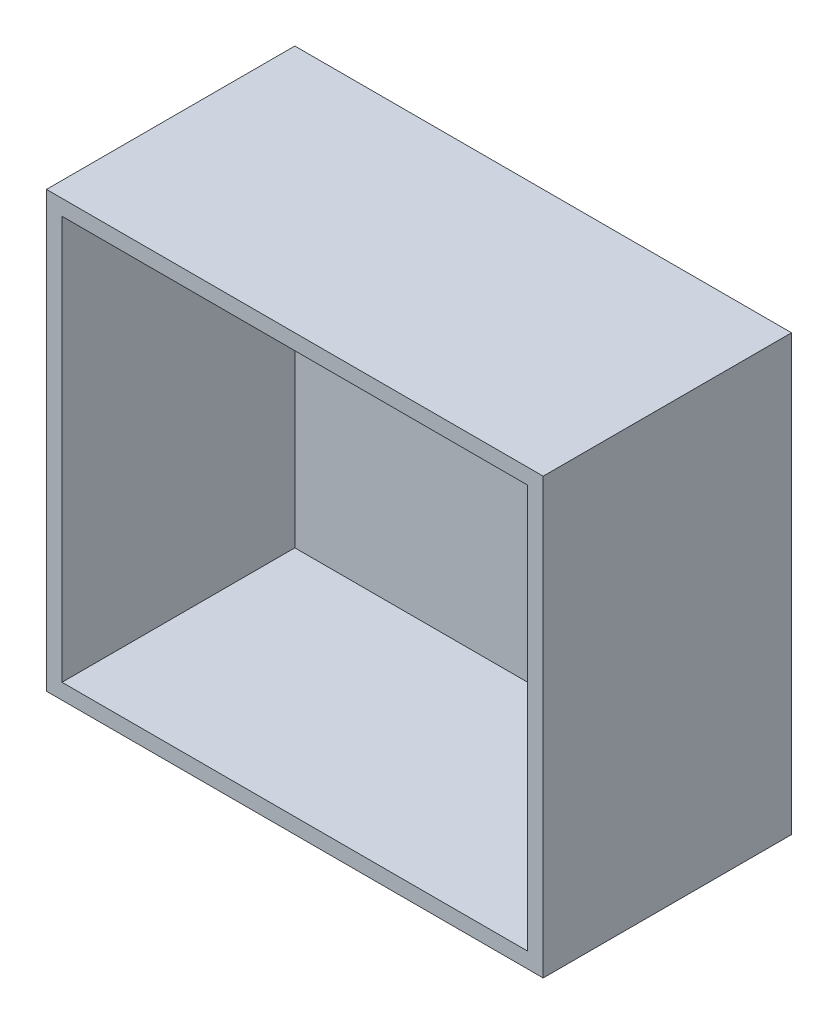
ISO-10303-21;
HEADER;
FILE_DESCRIPTION(('STEP AP214'),'2;1');
FILE_NAME('part.step','',(''),(''),'','','');
FILE_SCHEMA(('AUTOMOTIVE_DESIGN { 1 0 10303 214 1 1 1 1 }'));
ENDSEC;
DATA;
#1=APPLICATION_CONTEXT('core data for automotive mechanical design processes');
#2=APPLICATION_PROTOCOL_DEFINITION('international standard','automotive_design',2000,#1);
#3=PRODUCT_CONTEXT('',#1,'mechanical');
#4=PRODUCT('Part','Part','',(#3));
#5=PRODUCT_RELATED_PRODUCT_CATEGORY('part','',(#4));
#6=PRODUCT_DEFINITION_FORMATION('','',#4);
#7=PRODUCT_DEFINITION_CONTEXT('part definition',#1,'design');
#8=PRODUCT_DEFINITION('design','',#6,#7);
#9=PRODUCT_DEFINITION_SHAPE('','',#8);
#10=(LENGTH_UNIT() NAMED_UNIT(*) SI_UNIT(.MILLI.,.METRE.));
#11=(NAMED_UNIT(*) PLANE_ANGLE_UNIT() SI_UNIT($,.RADIAN.));
#12=(NAMED_UNIT(*) SI_UNIT($,.STERADIAN.) SOLID_ANGLE_UNIT());
#13=UNCERTAINTY_MEASURE_WITH_UNIT(LENGTH_MEASURE(1.E-05),#10,'distance_accuracy_value','');
#14=(GEOMETRIC_REPRESENTATION_CONTEXT(3) GLOBAL_UNCERTAINTY_ASSIGNED_CONTEXT((#13)) GLOBAL_UNIT_ASSIGNED_CONTEXT((#10,
#11,#12)) REPRESENTATION_CONTEXT('',''));
#15=CARTESIAN_POINT('',(0.,0.,0.));
#16=DIRECTION('',(0.,0.,1.));
#17=DIRECTION('',(1.,0.,0.));
#18=AXIS2_PLACEMENT_3D('',#15,#16,#17);
#19=CARTESIAN_POINT('',(0.,0.,32.));
#20=DIRECTION('',(1.,0.,0.));
#21=DIRECTION('',(0.,1.,0.));
#22=AXIS2_PLACEMENT_3D('',#19,#20,#21);
#23=PLANE('',#22);
#24=DIRECTION('',(0.,-1.,0.));
#25=VECTOR('',#24,1.);
#26=CARTESIAN_POINT('',(0.,0.,0.));
#27=LINE('',#26,#25);
#28=CARTESIAN_POINT('',(0.,56.,0.));
#29=VERTEX_POINT('',#28);
#30=CARTESIAN_POINT('',(0.,0.,0.));
#31=VERTEX_POINT('',#30);
#32=EDGE_CURVE('E164',#29,#31,#27,.T.);
#33=ORIENTED_EDGE('',*,*,#32,.T.);
#34=DIRECTION('',(0.,0.,-1.));
#35=VECTOR('',#34,1.);
#36=CARTESIAN_POINT('',(0.,0.,32.));
#37=LINE('',#36,#35);
#38=CARTESIAN_POINT('',(0.,0.,32.));
#39=VERTEX_POINT('',#38);
#40=EDGE_CURVE('E11',#39,#31,#37,.T.);
#41=ORIENTED_EDGE('',*,*,#40,.F.);
#42=DIRECTION('',(0.,-1.,0.));
#43=VECTOR('',#42,1.);
#44=CARTESIAN_POINT('',(0.,0.,32.));
#45=LINE('',#44,#43);
#46=CARTESIAN_POINT('',(0.,56.,32.));
#47=VERTEX_POINT('',#46);
#48=EDGE_CURVE('E170',#47,#39,#45,.T.);
#49=ORIENTED_EDGE('',*,*,#48,.F.);
#50=DIRECTION('',(0.,0.,-1.));
#51=VECTOR('',#50,1.);
#52=CARTESIAN_POINT('',(0.,56.,32.));
#53=LINE('',#52,#51);
#54=EDGE_CURVE('E180',#47,#29,#53,.T.);
#55=ORIENTED_EDGE('',*,*,#54,.T.);
#56=EDGE_LOOP('',(#33,#41,#49,#55));
#57=FACE_BOUND('',#56,.T.);
#58=ADVANCED_FACE('F45',(#57),#23,.F.);
#59=CARTESIAN_POINT('',(0.,0.,32.));
#60=DIRECTION('',(0.,1.,0.));
#61=DIRECTION('',(0.,0.,1.));
#62=AXIS2_PLACEMENT_3D('',#59,#60,#61);
#63=PLANE('',#62);
#64=DIRECTION('',(1.,0.,0.));
#65=VECTOR('',#64,1.);
#66=CARTESIAN_POINT('',(0.,0.,0.));
#67=LINE('',#66,#65);
#68=CARTESIAN_POINT('',(64.,0.,0.));
#69=VERTEX_POINT('',#68);
#70=EDGE_CURVE('E184',#31,#69,#67,.T.);
#71=ORIENTED_EDGE('',*,*,#70,.T.);
#72=DIRECTION('',(0.,0.,-1.));
#73=VECTOR('',#72,1.);
#74=CARTESIAN_POINT('',(64.,0.,32.));
#75=LINE('',#74,#73);
#76=CARTESIAN_POINT('',(64.,0.,32.));
#77=VERTEX_POINT('',#76);
#78=EDGE_CURVE('E53',#77,#69,#75,.T.);
#79=ORIENTED_EDGE('',*,*,#78,.F.);
#80=DIRECTION('',(1.,0.,0.));
#81=VECTOR('',#80,1.);
#82=CARTESIAN_POINT('',(0.,0.,32.));
#83=LINE('',#82,#81);
#84=EDGE_CURVE('E97',#39,#77,#83,.T.);
#85=ORIENTED_EDGE('',*,*,#84,.F.);
#86=ORIENTED_EDGE('',*,*,#40,.T.);
#87=EDGE_LOOP('',(#71,#79,#85,#86));
#88=FACE_BOUND('',#87,.T.);
#89=ADVANCED_FACE('F220',(#88),#63,.F.);
#90=CARTESIAN_POINT('',(64.,0.,32.));
#91=DIRECTION('',(-1.,0.,0.));
#92=DIRECTION('',(0.,0.,1.));
#93=AXIS2_PLACEMENT_3D('',#90,#91,#92);
#94=PLANE('',#93);
#95=DIRECTION('',(0.,1.,0.));
#96=VECTOR('',#95,1.);
#97=CARTESIAN_POINT('',(64.,0.,0.));
#98=LINE('',#97,#96);
#99=CARTESIAN_POINT('',(64.,56.,0.));
#100=VERTEX_POINT('',#99);
#101=EDGE_CURVE('E187',#69,#100,#98,.T.);
#102=ORIENTED_EDGE('',*,*,#101,.T.);
#103=DIRECTION('',(0.,0.,-1.));
#104=VECTOR('',#103,1.);
#105=CARTESIAN_POINT('',(64.,56.,32.));
#106=LINE('',#105,#104);
#107=CARTESIAN_POINT('',(64.,56.,32.));
#108=VERTEX_POINT('',#107);
#109=EDGE_CURVE('E194',#108,#100,#106,.T.);
#110=ORIENTED_EDGE('',*,*,#109,.F.);
#111=DIRECTION('',(0.,1.,0.));
#112=VECTOR('',#111,1.);
#113=CARTESIAN_POINT('',(64.,0.,32.));
#114=LINE('',#113,#112);
#115=EDGE_CURVE('E175',#77,#108,#114,.T.);
#116=ORIENTED_EDGE('',*,*,#115,.F.);
#117=ORIENTED_EDGE('',*,*,#78,.T.);
#118=EDGE_LOOP('',(#102,#110,#116,#117));
#119=FACE_BOUND('',#118,.T.);
#120=ADVANCED_FACE('F201',(#119),#94,.F.);
#121=CARTESIAN_POINT('',(0.,56.,32.));
#122=DIRECTION('',(0.,-1.,0.));
#123=DIRECTION('',(0.,0.,-1.));
#124=AXIS2_PLACEMENT_3D('',#121,#122,#123);
#125=PLANE('',#124);
#126=DIRECTION('',(-1.,0.,0.));
#127=VECTOR('',#126,1.);
#128=CARTESIAN_POINT('',(0.,56.,0.));
#129=LINE('',#128,#127);
#130=EDGE_CURVE('E90',#100,#29,#129,.T.);
#131=ORIENTED_EDGE('',*,*,#130,.T.);
#132=ORIENTED_EDGE('',*,*,#54,.F.);
#133=DIRECTION('',(-1.,0.,0.));
#134=VECTOR('',#133,1.);
#135=CARTESIAN_POINT('',(0.,56.,32.));
#136=LINE('',#135,#134);
#137=EDGE_CURVE('E69',#108,#47,#136,.T.);
#138=ORIENTED_EDGE('',*,*,#137,.F.);
#139=ORIENTED_EDGE('',*,*,#109,.T.);
#140=EDGE_LOOP('',(#131,#132,#138,#139));
#141=FACE_BOUND('',#140,.T.);
#142=ADVANCED_FACE('F209',(#141),#125,.F.);
#143=CARTESIAN_POINT('',(0.,0.,32.));
#144=DIRECTION('',(0.,0.,-1.));
#145=DIRECTION('',(-1.,0.,0.));
#146=AXIS2_PLACEMENT_3D('',#143,#144,#145);
#147=PLANE('',#146);
#148=DIRECTION('',(1.,0.,0.));
#149=VECTOR('',#148,1.);
#150=CARTESIAN_POINT('',(1.99999999999999,2.,32.));
#151=LINE('',#150,#149);
#152=CARTESIAN_POINT('',(1.99999999999999,2.,32.));
#153=VERTEX_POINT('',#152);
#154=CARTESIAN_POINT('',(62.,2.,32.));
#155=VERTEX_POINT('',#154);
#156=EDGE_CURVE('E155',#153,#155,#151,.T.);
#157=ORIENTED_EDGE('',*,*,#156,.F.);
#158=DIRECTION('',(0.,-1.,0.));
#159=VECTOR('',#158,1.);
#160=CARTESIAN_POINT('',(1.99999999999999,54.,32.));
#161=LINE('',#160,#159);
#162=CARTESIAN_POINT('',(1.99999999999999,54.,32.));
#163=VERTEX_POINT('',#162);
#164=EDGE_CURVE('E60',#163,#153,#161,.T.);
#165=ORIENTED_EDGE('',*,*,#164,.F.);
#166=DIRECTION('',(-1.,0.,0.));
#167=VECTOR('',#166,1.);
#168=CARTESIAN_POINT('',(1.99999999999999,54.,32.));
#169=LINE('',#168,#167);
#170=CARTESIAN_POINT('',(62.,54.,32.));
#171=VERTEX_POINT('',#170);
#172=EDGE_CURVE('E142',#171,#163,#169,.T.);
#173=ORIENTED_EDGE('',*,*,#172,.F.);
#174=DIRECTION('',(0.,1.,0.));
#175=VECTOR('',#174,1.);
#176=CARTESIAN_POINT('',(62.,54.,32.));
#177=LINE('',#176,#175);
#178=EDGE_CURVE('E146',#155,#171,#177,.T.);
#179=ORIENTED_EDGE('',*,*,#178,.F.);
#180=EDGE_LOOP('',(#157,#165,#173,#179));
#181=FACE_BOUND('',#180,.T.);
#182=ORIENTED_EDGE('',*,*,#48,.T.);
#183=ORIENTED_EDGE('',*,*,#84,.T.);
#184=ORIENTED_EDGE('',*,*,#115,.T.);
#185=ORIENTED_EDGE('',*,*,#137,.T.);
#186=EDGE_LOOP('',(#182,#183,#184,#185));
#187=FACE_BOUND('',#186,.T.);
#188=ADVANCED_FACE('F211',(#181,#187),#147,.F.);
#189=CARTESIAN_POINT('',(0.,0.,0.));
#190=DIRECTION('',(0.,0.,-1.));
#191=DIRECTION('',(-1.,0.,0.));
#192=AXIS2_PLACEMENT_3D('',#189,#190,#191);
#193=PLANE('',#192);
#194=ORIENTED_EDGE('',*,*,#32,.F.);
#195=ORIENTED_EDGE('',*,*,#130,.F.);
#196=ORIENTED_EDGE('',*,*,#101,.F.);
#197=ORIENTED_EDGE('',*,*,#70,.F.);
#198=EDGE_LOOP('',(#194,#195,#196,#197));
#199=FACE_BOUND('',#198,.T.);
#200=ADVANCED_FACE('F205',(#199),#193,.T.);
#201=CARTESIAN_POINT('',(1.99999999999999,54.,2.));
#202=DIRECTION('',(-1.,0.,0.));
#203=DIRECTION('',(0.,0.,1.));
#204=AXIS2_PLACEMENT_3D('',#201,#202,#203);
#205=PLANE('',#204);
#206=ORIENTED_EDGE('',*,*,#164,.T.);
#207=DIRECTION('',(0.,0.,1.));
#208=VECTOR('',#207,1.);
#209=CARTESIAN_POINT('',(1.99999999999999,2.,2.));
#210=LINE('',#209,#208);
#211=CARTESIAN_POINT('',(1.99999999999999,2.,2.));
#212=VERTEX_POINT('',#211);
#213=EDGE_CURVE('E117',#212,#153,#210,.T.);
#214=ORIENTED_EDGE('',*,*,#213,.F.);
#215=DIRECTION('',(0.,-1.,0.));
#216=VECTOR('',#215,1.);
#217=CARTESIAN_POINT('',(1.99999999999999,54.,2.));
#218=LINE('',#217,#216);
#219=CARTESIAN_POINT('',(1.99999999999999,54.,2.));
#220=VERTEX_POINT('',#219);
#221=EDGE_CURVE('E121',#220,#212,#218,.T.);
#222=ORIENTED_EDGE('',*,*,#221,.F.);
#223=DIRECTION('',(0.,0.,1.));
#224=VECTOR('',#223,1.);
#225=CARTESIAN_POINT('',(1.99999999999999,54.,2.));
#226=LINE('',#225,#224);
#227=EDGE_CURVE('E161',#220,#163,#226,.T.);
#228=ORIENTED_EDGE('',*,*,#227,.T.);
#229=EDGE_LOOP('',(#206,#214,#222,#228));
#230=FACE_BOUND('',#229,.T.);
#231=ADVANCED_FACE('F119',(#230),#205,.F.);
#232=CARTESIAN_POINT('',(1.99999999999999,54.,2.));
#233=DIRECTION('',(0.,1.,0.));
#234=DIRECTION('',(0.,0.,1.));
#235=AXIS2_PLACEMENT_3D('',#232,#233,#234);
#236=PLANE('',#235);
#237=ORIENTED_EDGE('',*,*,#172,.T.);
#238=ORIENTED_EDGE('',*,*,#227,.F.);
#239=DIRECTION('',(-1.,0.,0.));
#240=VECTOR('',#239,1.);
#241=CARTESIAN_POINT('',(1.99999999999999,54.,2.));
#242=LINE('',#241,#240);
#243=CARTESIAN_POINT('',(62.,54.,2.));
#244=VERTEX_POINT('',#243);
#245=EDGE_CURVE('E128',#244,#220,#242,.T.);
#246=ORIENTED_EDGE('',*,*,#245,.F.);
#247=DIRECTION('',(0.,0.,1.));
#248=VECTOR('',#247,1.);
#249=CARTESIAN_POINT('',(62.,54.,2.));
#250=LINE('',#249,#248);
#251=EDGE_CURVE('E165',#244,#171,#250,.T.);
#252=ORIENTED_EDGE('',*,*,#251,.T.);
#253=EDGE_LOOP('',(#237,#238,#246,#252));
#254=FACE_BOUND('',#253,.T.);
#255=ADVANCED_FACE('F260',(#254),#236,.F.);
#256=CARTESIAN_POINT('',(62.,54.,2.));
#257=DIRECTION('',(1.,0.,0.));
#258=DIRECTION('',(0.,1.,0.));
#259=AXIS2_PLACEMENT_3D('',#256,#257,#258);
#260=PLANE('',#259);
#261=ORIENTED_EDGE('',*,*,#178,.T.);
#262=ORIENTED_EDGE('',*,*,#251,.F.);
#263=DIRECTION('',(0.,1.,0.));
#264=VECTOR('',#263,1.);
#265=CARTESIAN_POINT('',(62.,54.,2.));
#266=LINE('',#265,#264);
#267=CARTESIAN_POINT('',(62.,2.,2.));
#268=VERTEX_POINT('',#267);
#269=EDGE_CURVE('E137',#268,#244,#266,.T.);
#270=ORIENTED_EDGE('',*,*,#269,.F.);
#271=DIRECTION('',(0.,0.,1.));
#272=VECTOR('',#271,1.);
#273=CARTESIAN_POINT('',(62.,2.,2.));
#274=LINE('',#273,#272);
#275=EDGE_CURVE('E127',#268,#155,#274,.T.);
#276=ORIENTED_EDGE('',*,*,#275,.T.);
#277=EDGE_LOOP('',(#261,#262,#270,#276));
#278=FACE_BOUND('',#277,.T.);
#279=ADVANCED_FACE('F269',(#278),#260,.F.);
#280=CARTESIAN_POINT('',(1.99999999999999,2.,2.));
#281=DIRECTION('',(0.,-1.,0.));
#282=DIRECTION('',(0.,0.,-1.));
#283=AXIS2_PLACEMENT_3D('',#280,#281,#282);
#284=PLANE('',#283);
#285=ORIENTED_EDGE('',*,*,#156,.T.);
#286=ORIENTED_EDGE('',*,*,#275,.F.);
#287=DIRECTION('',(1.,0.,0.));
#288=VECTOR('',#287,1.);
#289=CARTESIAN_POINT('',(1.99999999999999,2.,2.));
#290=LINE('',#289,#288);
#291=EDGE_CURVE('E131',#212,#268,#290,.T.);
#292=ORIENTED_EDGE('',*,*,#291,.F.);
#293=ORIENTED_EDGE('',*,*,#213,.T.);
#294=EDGE_LOOP('',(#285,#286,#292,#293));
#295=FACE_BOUND('',#294,.T.);
#296=ADVANCED_FACE('F132',(#295),#284,.F.);
#297=CARTESIAN_POINT('',(0.,0.,2.));
#298=DIRECTION('',(0.,0.,1.));
#299=DIRECTION('',(1.,0.,0.));
#300=AXIS2_PLACEMENT_3D('',#297,#298,#299);
#301=PLANE('',#300);
#302=ORIENTED_EDGE('',*,*,#221,.T.);
#303=ORIENTED_EDGE('',*,*,#291,.T.);
#304=ORIENTED_EDGE('',*,*,#269,.T.);
#305=ORIENTED_EDGE('',*,*,#245,.T.);
#306=EDGE_LOOP('',(#302,#303,#304,#305));
#307=FACE_BOUND('',#306,.T.);
#308=ADVANCED_FACE('F139',(#307),#301,.T.);
#309=CLOSED_SHELL('',(#58,#89,#120,#142,#188,#200,#231,#255,#279,#296,#308));
#310=MANIFOLD_SOLID_BREP('B2',#309);
#311=ADVANCED_BREP_SHAPE_REPRESENTATION('',(#18,#310),#14);
#312=SHAPE_DEFINITION_REPRESENTATION(#9,#311);
ENDSEC;
END-ISO-10303-21;
